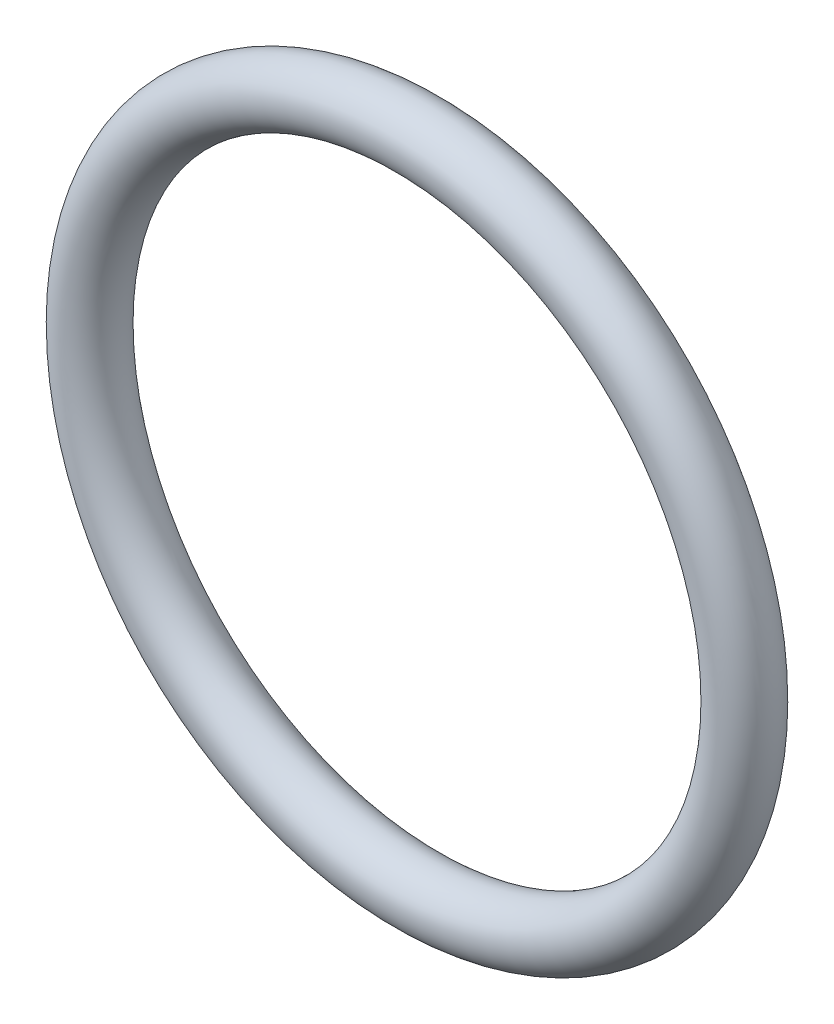
ISO-10303-21;
HEADER;
FILE_DESCRIPTION(('STEP AP214'),'2;1');
FILE_NAME('part.step','',(''),(''),'','','');
FILE_SCHEMA(('AUTOMOTIVE_DESIGN { 1 0 10303 214 1 1 1 1 }'));
ENDSEC;
DATA;
#1=APPLICATION_CONTEXT('core data for automotive mechanical design processes');
#2=APPLICATION_PROTOCOL_DEFINITION('international standard','automotive_design',2000,#1);
#3=PRODUCT_CONTEXT('',#1,'mechanical');
#4=PRODUCT('Part','Part','',(#3));
#5=PRODUCT_RELATED_PRODUCT_CATEGORY('part','',(#4));
#6=PRODUCT_DEFINITION_FORMATION('','',#4);
#7=PRODUCT_DEFINITION_CONTEXT('part definition',#1,'design');
#8=PRODUCT_DEFINITION('design','',#6,#7);
#9=PRODUCT_DEFINITION_SHAPE('','',#8);
#10=(LENGTH_UNIT() NAMED_UNIT(*) SI_UNIT(.MILLI.,.METRE.));
#11=(NAMED_UNIT(*) PLANE_ANGLE_UNIT() SI_UNIT($,.RADIAN.));
#12=(NAMED_UNIT(*) SI_UNIT($,.STERADIAN.) SOLID_ANGLE_UNIT());
#13=UNCERTAINTY_MEASURE_WITH_UNIT(LENGTH_MEASURE(1.E-05),#10,'distance_accuracy_value','');
#14=(GEOMETRIC_REPRESENTATION_CONTEXT(3) GLOBAL_UNCERTAINTY_ASSIGNED_CONTEXT((#13)) GLOBAL_UNIT_ASSIGNED_CONTEXT((#10,
#11,#12)) REPRESENTATION_CONTEXT('',''));
#15=CARTESIAN_POINT('',(0.,0.,0.));
#16=DIRECTION('',(0.,0.,1.));
#17=DIRECTION('',(1.,0.,0.));
#18=AXIS2_PLACEMENT_3D('',#15,#16,#17);
#19=CARTESIAN_POINT('',(0.,0.,0.));
#20=DIRECTION('',(0.,0.,1.));
#21=DIRECTION('',(1.,0.,0.));
#22=AXIS2_PLACEMENT_3D('',#19,#20,#21);
#23=TOROIDAL_SURFACE('',#22,9.4742,0.888999999999998);
#24=CARTESIAN_POINT('',(10.3632,0.,0.));
#25=VERTEX_POINT('',#24);
#26=VERTEX_LOOP('',#25);
#27=FACE_BOUND('',#26,.T.);
#28=ADVANCED_FACE('F28',(#27),#23,.T.);
#29=CLOSED_SHELL('',(#28));
#30=MANIFOLD_SOLID_BREP('B2',#29);
#31=ADVANCED_BREP_SHAPE_REPRESENTATION('',(#18,#30),#14);
#32=SHAPE_DEFINITION_REPRESENTATION(#9,#31);
ENDSEC;
END-ISO-10303-21;
